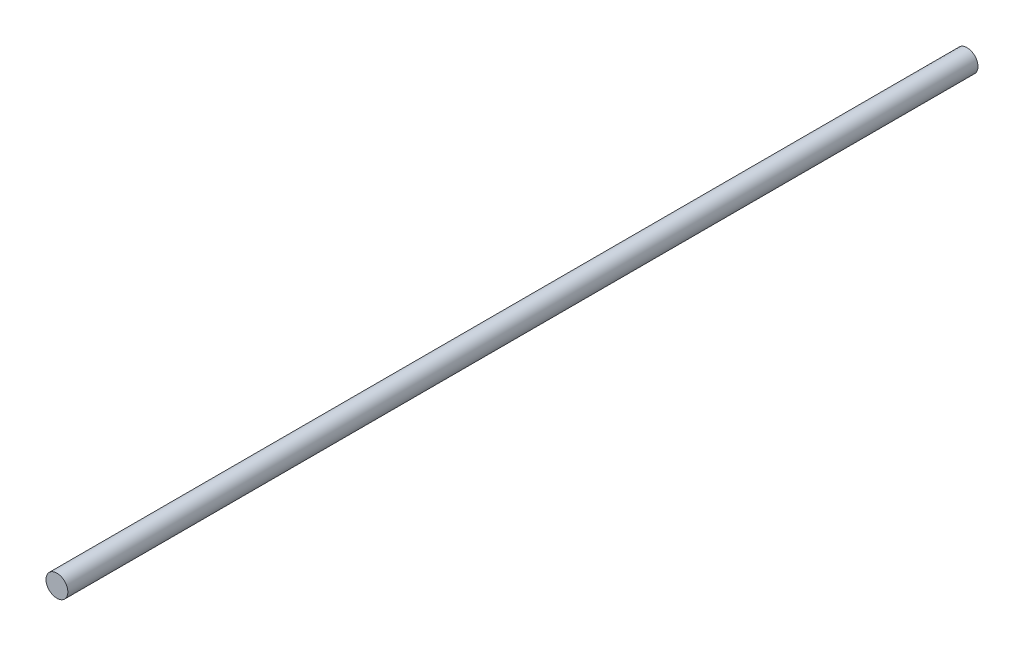
ISO-10303-21;
HEADER;
FILE_DESCRIPTION(('STEP AP214'),'2;1');
FILE_NAME('part.step','',(''),(''),'','','');
FILE_SCHEMA(('AUTOMOTIVE_DESIGN { 1 0 10303 214 1 1 1 1 }'));
ENDSEC;
DATA;
#1=APPLICATION_CONTEXT('core data for automotive mechanical design processes');
#2=APPLICATION_PROTOCOL_DEFINITION('international standard','automotive_design',2000,#1);
#3=PRODUCT_CONTEXT('',#1,'mechanical');
#4=PRODUCT('Part','Part','',(#3));
#5=PRODUCT_RELATED_PRODUCT_CATEGORY('part','',(#4));
#6=PRODUCT_DEFINITION_FORMATION('','',#4);
#7=PRODUCT_DEFINITION_CONTEXT('part definition',#1,'design');
#8=PRODUCT_DEFINITION('design','',#6,#7);
#9=PRODUCT_DEFINITION_SHAPE('','',#8);
#10=(LENGTH_UNIT() NAMED_UNIT(*) SI_UNIT(.MILLI.,.METRE.));
#11=(NAMED_UNIT(*) PLANE_ANGLE_UNIT() SI_UNIT($,.RADIAN.));
#12=(NAMED_UNIT(*) SI_UNIT($,.STERADIAN.) SOLID_ANGLE_UNIT());
#13=UNCERTAINTY_MEASURE_WITH_UNIT(LENGTH_MEASURE(1.E-05),#10,'distance_accuracy_value','');
#14=(GEOMETRIC_REPRESENTATION_CONTEXT(3) GLOBAL_UNCERTAINTY_ASSIGNED_CONTEXT((#13)) GLOBAL_UNIT_ASSIGNED_CONTEXT((#10,
#11,#12)) REPRESENTATION_CONTEXT('',''));
#15=CARTESIAN_POINT('',(0.,0.,0.));
#16=DIRECTION('',(0.,0.,1.));
#17=DIRECTION('',(1.,0.,0.));
#18=AXIS2_PLACEMENT_3D('',#15,#16,#17);
#19=CARTESIAN_POINT('',(0.,0.,500.));
#20=DIRECTION('',(0.,0.,-1.));
#21=DIRECTION('',(-1.,0.,0.));
#22=AXIS2_PLACEMENT_3D('',#19,#20,#21);
#23=CYLINDRICAL_SURFACE('',#22,6.);
#24=CARTESIAN_POINT('',(0.,0.,500.));
#25=DIRECTION('',(0.,0.,1.));
#26=DIRECTION('',(1.,0.,0.));
#27=AXIS2_PLACEMENT_3D('',#24,#25,#26);
#28=CIRCLE('',#27,6.);
#29=CARTESIAN_POINT('',(6.,0.,500.));
#30=VERTEX_POINT('',#29);
#31=EDGE_CURVE('E10',#30,#30,#28,.T.);
#32=ORIENTED_EDGE('',*,*,#31,.F.);
#33=EDGE_LOOP('',(#32));
#34=FACE_BOUND('',#33,.T.);
#35=CARTESIAN_POINT('',(0.,0.,0.));
#36=DIRECTION('',(0.,0.,1.));
#37=DIRECTION('',(1.,0.,0.));
#38=AXIS2_PLACEMENT_3D('',#35,#36,#37);
#39=CIRCLE('',#38,6.);
#40=CARTESIAN_POINT('',(6.,0.,0.));
#41=VERTEX_POINT('',#40);
#42=EDGE_CURVE('E32',#41,#41,#39,.T.);
#43=ORIENTED_EDGE('',*,*,#42,.T.);
#44=EDGE_LOOP('',(#43));
#45=FACE_BOUND('',#44,.T.);
#46=ADVANCED_FACE('F29',(#34,#45),#23,.T.);
#47=CARTESIAN_POINT('',(0.,0.,500.));
#48=DIRECTION('',(0.,0.,1.));
#49=DIRECTION('',(1.,0.,0.));
#50=AXIS2_PLACEMENT_3D('',#47,#48,#49);
#51=PLANE('',#50);
#52=ORIENTED_EDGE('',*,*,#31,.T.);
#53=EDGE_LOOP('',(#52));
#54=FACE_BOUND('',#53,.T.);
#55=ADVANCED_FACE('F44',(#54),#51,.T.);
#56=CARTESIAN_POINT('',(0.,0.,0.));
#57=DIRECTION('',(0.,0.,1.));
#58=DIRECTION('',(1.,0.,0.));
#59=AXIS2_PLACEMENT_3D('',#56,#57,#58);
#60=PLANE('',#59);
#61=ORIENTED_EDGE('',*,*,#42,.F.);
#62=EDGE_LOOP('',(#61));
#63=FACE_BOUND('',#62,.T.);
#64=ADVANCED_FACE('F42',(#63),#60,.F.);
#65=CLOSED_SHELL('',(#46,#55,#64));
#66=MANIFOLD_SOLID_BREP('B2',#65);
#67=ADVANCED_BREP_SHAPE_REPRESENTATION('',(#18,#66),#14);
#68=SHAPE_DEFINITION_REPRESENTATION(#9,#67);
ENDSEC;
END-ISO-10303-21;
